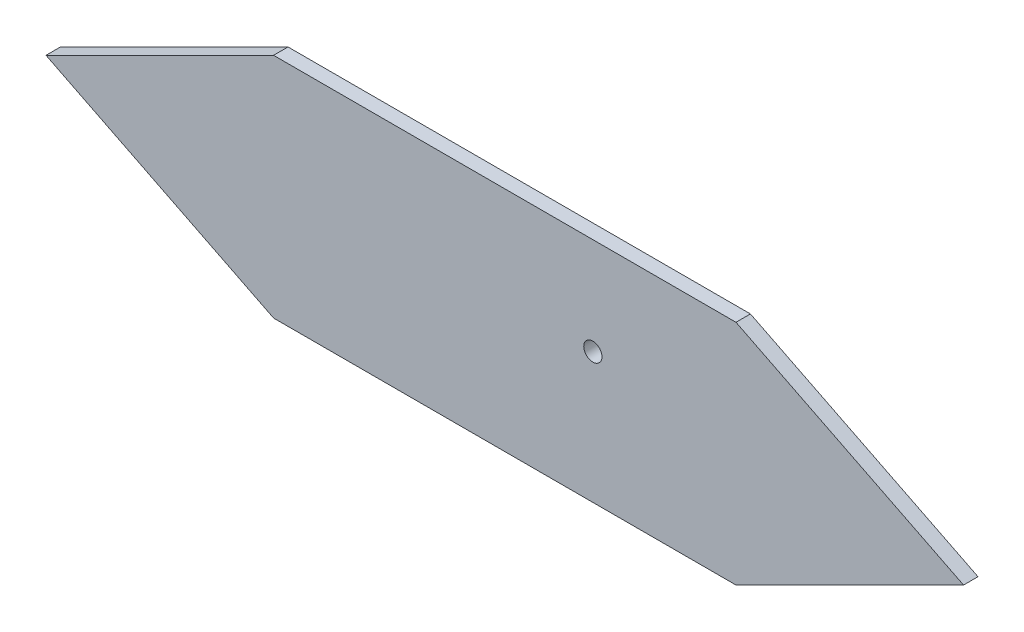
ISO-10303-21;
HEADER;
FILE_DESCRIPTION(('STEP AP214'),'2;1');
FILE_NAME('part.step','',(''),(''),'','','');
FILE_SCHEMA(('AUTOMOTIVE_DESIGN { 1 0 10303 214 1 1 1 1 }'));
ENDSEC;
DATA;
#1=APPLICATION_CONTEXT('core data for automotive mechanical design processes');
#2=APPLICATION_PROTOCOL_DEFINITION('international standard','automotive_design',2000,#1);
#3=PRODUCT_CONTEXT('',#1,'mechanical');
#4=PRODUCT('Part','Part','',(#3));
#5=PRODUCT_RELATED_PRODUCT_CATEGORY('part','',(#4));
#6=PRODUCT_DEFINITION_FORMATION('','',#4);
#7=PRODUCT_DEFINITION_CONTEXT('part definition',#1,'design');
#8=PRODUCT_DEFINITION('design','',#6,#7);
#9=PRODUCT_DEFINITION_SHAPE('','',#8);
#10=(LENGTH_UNIT() NAMED_UNIT(*) SI_UNIT(.MILLI.,.METRE.));
#11=(NAMED_UNIT(*) PLANE_ANGLE_UNIT() SI_UNIT($,.RADIAN.));
#12=(NAMED_UNIT(*) SI_UNIT($,.STERADIAN.) SOLID_ANGLE_UNIT());
#13=UNCERTAINTY_MEASURE_WITH_UNIT(LENGTH_MEASURE(1.E-05),#10,'distance_accuracy_value','');
#14=(GEOMETRIC_REPRESENTATION_CONTEXT(3) GLOBAL_UNCERTAINTY_ASSIGNED_CONTEXT((#13)) GLOBAL_UNIT_ASSIGNED_CONTEXT((#10,
#11,#12)) REPRESENTATION_CONTEXT('',''));
#15=CARTESIAN_POINT('',(0.,0.,0.));
#16=DIRECTION('',(0.,0.,1.));
#17=DIRECTION('',(1.,0.,0.));
#18=AXIS2_PLACEMENT_3D('',#15,#16,#17);
#19=CARTESIAN_POINT('',(0.,0.,0.));
#20=DIRECTION('',(0.,0.,1.));
#21=DIRECTION('',(1.,0.,0.));
#22=AXIS2_PLACEMENT_3D('',#19,#20,#21);
#23=PLANE('',#22);
#24=CARTESIAN_POINT('',(140.3,57.4,0.));
#25=DIRECTION('',(0.,0.,-1.));
#26=DIRECTION('',(-1.,0.,0.));
#27=AXIS2_PLACEMENT_3D('',#24,#25,#26);
#28=CIRCLE('',#27,3.99999999999999);
#29=CARTESIAN_POINT('',(136.3,57.4,0.));
#30=VERTEX_POINT('',#29);
#31=EDGE_CURVE('E723',#30,#30,#28,.T.);
#32=ORIENTED_EDGE('',*,*,#31,.F.);
#33=EDGE_LOOP('',(#32));
#34=FACE_BOUND('',#33,.T.);
#35=DIRECTION('',(-0.894427190999916,-0.447213595499958,0.));
#36=VECTOR('',#35,1.);
#37=CARTESIAN_POINT('',(-40.,80.,0.));
#38=LINE('',#37,#36);
#39=CARTESIAN_POINT('',(0.,100.,0.));
#40=VERTEX_POINT('',#39);
#41=CARTESIAN_POINT('',(-100.,50.,0.));
#42=VERTEX_POINT('',#41);
#43=EDGE_CURVE('E345',#40,#42,#38,.T.);
#44=ORIENTED_EDGE('',*,*,#43,.F.);
#45=DIRECTION('',(1.,0.,0.));
#46=VECTOR('',#45,1.);
#47=CARTESIAN_POINT('',(0.,100.,0.));
#48=LINE('',#47,#46);
#49=CARTESIAN_POINT('',(203.2,100.,0.));
#50=VERTEX_POINT('',#49);
#51=EDGE_CURVE('E350',#40,#50,#48,.T.);
#52=ORIENTED_EDGE('',*,*,#51,.T.);
#53=DIRECTION('',(0.894427190999916,-0.447213595499958,0.));
#54=VECTOR('',#53,1.);
#55=CARTESIAN_POINT('',(80.64,161.28,0.));
#56=LINE('',#55,#54);
#57=CARTESIAN_POINT('',(303.2,50.,0.));
#58=VERTEX_POINT('',#57);
#59=EDGE_CURVE('E374',#50,#58,#56,.T.);
#60=ORIENTED_EDGE('',*,*,#59,.T.);
#61=DIRECTION('',(-0.894427190999916,-0.447213595499958,0.));
#62=VECTOR('',#61,1.);
#63=CARTESIAN_POINT('',(40.64,-81.28,0.));
#64=LINE('',#63,#62);
#65=CARTESIAN_POINT('',(203.2,0.,0.));
#66=VERTEX_POINT('',#65);
#67=EDGE_CURVE('E371',#58,#66,#64,.T.);
#68=ORIENTED_EDGE('',*,*,#67,.T.);
#69=DIRECTION('',(1.,0.,0.));
#70=VECTOR('',#69,1.);
#71=CARTESIAN_POINT('',(0.,0.,0.));
#72=LINE('',#71,#70);
#73=CARTESIAN_POINT('',(0.,0.,0.));
#74=VERTEX_POINT('',#73);
#75=EDGE_CURVE('E368',#74,#66,#72,.T.);
#76=ORIENTED_EDGE('',*,*,#75,.F.);
#77=DIRECTION('',(0.894427190999916,-0.447213595499958,0.));
#78=VECTOR('',#77,1.);
#79=CARTESIAN_POINT('',(0.,0.,0.));
#80=LINE('',#79,#78);
#81=EDGE_CURVE('E366',#42,#74,#80,.T.);
#82=ORIENTED_EDGE('',*,*,#81,.F.);
#83=EDGE_LOOP('',(#44,#52,#60,#68,#76,#82));
#84=FACE_BOUND('',#83,.T.);
#85=DIRECTION('',(0.,-1.,0.));
#86=VECTOR('',#85,1.);
#87=CARTESIAN_POINT('',(0.,0.,0.));
#88=LINE('',#87,#86);
#89=CARTESIAN_POINT('',(0.,19.05,0.));
#90=VERTEX_POINT('',#89);
#91=CARTESIAN_POINT('',(0.,12.7,0.));
#92=VERTEX_POINT('',#91);
#93=EDGE_CURVE('E312',#90,#92,#88,.T.);
#94=ORIENTED_EDGE('',*,*,#93,.F.);
#95=DIRECTION('',(1.,0.,0.));
#96=VECTOR('',#95,1.);
#97=CARTESIAN_POINT('',(0.,19.05,0.));
#98=LINE('',#97,#96);
#99=CARTESIAN_POINT('',(25.4,19.05,0.));
#100=VERTEX_POINT('',#99);
#101=EDGE_CURVE('E243',#90,#100,#98,.T.);
#102=ORIENTED_EDGE('',*,*,#101,.T.);
#103=DIRECTION('',(0.,1.,0.));
#104=VECTOR('',#103,1.);
#105=CARTESIAN_POINT('',(25.4,0.,0.));
#106=LINE('',#105,#104);
#107=CARTESIAN_POINT('',(25.4,25.05,0.));
#108=VERTEX_POINT('',#107);
#109=EDGE_CURVE('E292',#100,#108,#106,.T.);
#110=ORIENTED_EDGE('',*,*,#109,.T.);
#111=DIRECTION('',(1.,0.,0.));
#112=VECTOR('',#111,1.);
#113=CARTESIAN_POINT('',(0.,25.05,0.));
#114=LINE('',#113,#112);
#115=CARTESIAN_POINT('',(-6.00000000000001,25.05,0.));
#116=VERTEX_POINT('',#115);
#117=EDGE_CURVE('E92',#116,#108,#114,.T.);
#118=ORIENTED_EDGE('',*,*,#117,.F.);
#119=DIRECTION('',(0.,-1.,0.));
#120=VECTOR('',#119,1.);
#121=CARTESIAN_POINT('',(-6.00000000000001,0.,0.));
#122=LINE('',#121,#120);
#123=CARTESIAN_POINT('',(-6.00000000000001,6.69999999999998,0.));
#124=VERTEX_POINT('',#123);
#125=EDGE_CURVE('E323',#116,#124,#122,.T.);
#126=ORIENTED_EDGE('',*,*,#125,.T.);
#127=DIRECTION('',(-1.,0.,0.));
#128=VECTOR('',#127,1.);
#129=CARTESIAN_POINT('',(0.,6.69999999999998,0.));
#130=LINE('',#129,#128);
#131=CARTESIAN_POINT('',(25.4,6.69999999999998,0.));
#132=VERTEX_POINT('',#131);
#133=EDGE_CURVE('E320',#132,#124,#130,.T.);
#134=ORIENTED_EDGE('',*,*,#133,.F.);
#135=DIRECTION('',(0.,1.,0.));
#136=VECTOR('',#135,1.);
#137=CARTESIAN_POINT('',(25.4,0.,0.));
#138=LINE('',#137,#136);
#139=CARTESIAN_POINT('',(25.4,12.7,0.));
#140=VERTEX_POINT('',#139);
#141=EDGE_CURVE('E317',#132,#140,#138,.T.);
#142=ORIENTED_EDGE('',*,*,#141,.T.);
#143=DIRECTION('',(1.,0.,0.));
#144=VECTOR('',#143,1.);
#145=CARTESIAN_POINT('',(0.,12.7,0.));
#146=LINE('',#145,#144);
#147=EDGE_CURVE('E314',#92,#140,#146,.T.);
#148=ORIENTED_EDGE('',*,*,#147,.F.);
#149=EDGE_LOOP('',(#94,#102,#110,#118,#126,#134,#142,#148));
#150=FACE_BOUND('',#149,.T.);
#151=DIRECTION('',(-1.,0.,0.));
#152=VECTOR('',#151,1.);
#153=CARTESIAN_POINT('',(0.,19.05,0.));
#154=LINE('',#153,#152);
#155=CARTESIAN_POINT('',(203.2,19.05,0.));
#156=VERTEX_POINT('',#155);
#157=CARTESIAN_POINT('',(177.8,19.05,0.));
#158=VERTEX_POINT('',#157);
#159=EDGE_CURVE('E235',#156,#158,#154,.T.);
#160=ORIENTED_EDGE('',*,*,#159,.F.);
#161=DIRECTION('',(0.,1.,0.));
#162=VECTOR('',#161,1.);
#163=CARTESIAN_POINT('',(203.2,0.,0.));
#164=LINE('',#163,#162);
#165=CARTESIAN_POINT('',(203.2,12.7,0.));
#166=VERTEX_POINT('',#165);
#167=EDGE_CURVE('E264',#166,#156,#164,.T.);
#168=ORIENTED_EDGE('',*,*,#167,.F.);
#169=DIRECTION('',(-1.,0.,0.));
#170=VECTOR('',#169,1.);
#171=CARTESIAN_POINT('',(203.2,12.7,0.));
#172=LINE('',#171,#170);
#173=CARTESIAN_POINT('',(177.8,12.7,0.));
#174=VERTEX_POINT('',#173);
#175=EDGE_CURVE('E241',#166,#174,#172,.T.);
#176=ORIENTED_EDGE('',*,*,#175,.T.);
#177=DIRECTION('',(0.,1.,0.));
#178=VECTOR('',#177,1.);
#179=CARTESIAN_POINT('',(177.8,6.69999999999998,0.));
#180=LINE('',#179,#178);
#181=CARTESIAN_POINT('',(177.8,6.69999999999998,0.));
#182=VERTEX_POINT('',#181);
#183=EDGE_CURVE('E84',#182,#174,#180,.T.);
#184=ORIENTED_EDGE('',*,*,#183,.F.);
#185=DIRECTION('',(-1.,0.,0.));
#186=VECTOR('',#185,1.);
#187=CARTESIAN_POINT('',(203.2,6.69999999999998,0.));
#188=LINE('',#187,#186);
#189=CARTESIAN_POINT('',(209.2,6.69999999999998,0.));
#190=VERTEX_POINT('',#189);
#191=EDGE_CURVE('E221',#190,#182,#188,.T.);
#192=ORIENTED_EDGE('',*,*,#191,.F.);
#193=DIRECTION('',(0.,-1.,0.));
#194=VECTOR('',#193,1.);
#195=CARTESIAN_POINT('',(209.2,0.,0.));
#196=LINE('',#195,#194);
#197=CARTESIAN_POINT('',(209.2,25.05,0.));
#198=VERTEX_POINT('',#197);
#199=EDGE_CURVE('E266',#198,#190,#196,.T.);
#200=ORIENTED_EDGE('',*,*,#199,.F.);
#201=DIRECTION('',(-1.,0.,0.));
#202=VECTOR('',#201,1.);
#203=CARTESIAN_POINT('',(0.,25.05,0.));
#204=LINE('',#203,#202);
#205=CARTESIAN_POINT('',(177.8,25.05,0.));
#206=VERTEX_POINT('',#205);
#207=EDGE_CURVE('E269',#198,#206,#204,.T.);
#208=ORIENTED_EDGE('',*,*,#207,.T.);
#209=DIRECTION('',(0.,1.,0.));
#210=VECTOR('',#209,1.);
#211=CARTESIAN_POINT('',(177.8,0.,0.));
#212=LINE('',#211,#210);
#213=EDGE_CURVE('E272',#158,#206,#212,.T.);
#214=ORIENTED_EDGE('',*,*,#213,.F.);
#215=EDGE_LOOP('',(#160,#168,#176,#184,#192,#200,#208,#214));
#216=FACE_BOUND('',#215,.T.);
#217=ADVANCED_FACE('F68',(#34,#84,#150,#216),#23,.F.);
#218=CARTESIAN_POINT('',(-40.,80.,6.35));
#219=DIRECTION('',(0.447213595499958,-0.894427190999916,0.));
#220=DIRECTION('',(0.894427190999916,0.447213595499958,0.));
#221=AXIS2_PLACEMENT_3D('',#218,#219,#220);
#222=PLANE('',#221);
#223=ORIENTED_EDGE('',*,*,#43,.T.);
#224=DIRECTION('',(0.,0.,-1.));
#225=VECTOR('',#224,1.);
#226=CARTESIAN_POINT('',(-100.,50.,6.35));
#227=LINE('',#226,#225);
#228=CARTESIAN_POINT('',(-100.,50.,6.35));
#229=VERTEX_POINT('',#228);
#230=EDGE_CURVE('E12',#229,#42,#227,.T.);
#231=ORIENTED_EDGE('',*,*,#230,.F.);
#232=DIRECTION('',(-0.894427190999916,-0.447213595499958,0.));
#233=VECTOR('',#232,1.);
#234=CARTESIAN_POINT('',(-40.,80.,6.35));
#235=LINE('',#234,#233);
#236=CARTESIAN_POINT('',(0.,100.,6.35));
#237=VERTEX_POINT('',#236);
#238=EDGE_CURVE('E346',#237,#229,#235,.T.);
#239=ORIENTED_EDGE('',*,*,#238,.F.);
#240=DIRECTION('',(0.,0.,-1.));
#241=VECTOR('',#240,1.);
#242=CARTESIAN_POINT('',(0.,100.,6.35));
#243=LINE('',#242,#241);
#244=EDGE_CURVE('E363',#237,#40,#243,.T.);
#245=ORIENTED_EDGE('',*,*,#244,.T.);
#246=EDGE_LOOP('',(#223,#231,#239,#245));
#247=FACE_BOUND('',#246,.T.);
#248=ADVANCED_FACE('F70',(#247),#222,.F.);
#249=CARTESIAN_POINT('',(0.,0.,6.35));
#250=DIRECTION('',(0.447213595499958,0.894427190999916,0.));
#251=DIRECTION('',(-0.894427190999916,0.447213595499958,0.));
#252=AXIS2_PLACEMENT_3D('',#249,#250,#251);
#253=PLANE('',#252);
#254=ORIENTED_EDGE('',*,*,#81,.T.);
#255=DIRECTION('',(0.,0.,-1.));
#256=VECTOR('',#255,1.);
#257=CARTESIAN_POINT('',(0.,0.,6.35));
#258=LINE('',#257,#256);
#259=CARTESIAN_POINT('',(0.,0.,6.35));
#260=VERTEX_POINT('',#259);
#261=EDGE_CURVE('E77',#260,#74,#258,.T.);
#262=ORIENTED_EDGE('',*,*,#261,.F.);
#263=DIRECTION('',(0.894427190999916,-0.447213595499958,0.));
#264=VECTOR('',#263,1.);
#265=CARTESIAN_POINT('',(0.,0.,6.35));
#266=LINE('',#265,#264);
#267=EDGE_CURVE('E349',#229,#260,#266,.T.);
#268=ORIENTED_EDGE('',*,*,#267,.F.);
#269=ORIENTED_EDGE('',*,*,#230,.T.);
#270=EDGE_LOOP('',(#254,#262,#268,#269));
#271=FACE_BOUND('',#270,.T.);
#272=ADVANCED_FACE('F414',(#271),#253,.F.);
#273=CARTESIAN_POINT('',(0.,0.,6.35));
#274=DIRECTION('',(0.,1.,0.));
#275=DIRECTION('',(0.,0.,1.));
#276=AXIS2_PLACEMENT_3D('',#273,#274,#275);
#277=PLANE('',#276);
#278=ORIENTED_EDGE('',*,*,#75,.T.);
#279=DIRECTION('',(0.,0.,-1.));
#280=VECTOR('',#279,1.);
#281=CARTESIAN_POINT('',(203.2,0.,6.35));
#282=LINE('',#281,#280);
#283=CARTESIAN_POINT('',(203.2,0.,6.35));
#284=VERTEX_POINT('',#283);
#285=EDGE_CURVE('E384',#284,#66,#282,.T.);
#286=ORIENTED_EDGE('',*,*,#285,.F.);
#287=DIRECTION('',(1.,0.,0.));
#288=VECTOR('',#287,1.);
#289=CARTESIAN_POINT('',(0.,0.,6.35));
#290=LINE('',#289,#288);
#291=EDGE_CURVE('E352',#260,#284,#290,.T.);
#292=ORIENTED_EDGE('',*,*,#291,.F.);
#293=ORIENTED_EDGE('',*,*,#261,.T.);
#294=EDGE_LOOP('',(#278,#286,#292,#293));
#295=FACE_BOUND('',#294,.T.);
#296=ADVANCED_FACE('F391',(#295),#277,.F.);
#297=CARTESIAN_POINT('',(40.64,-81.28,6.35));
#298=DIRECTION('',(0.447213595499958,-0.894427190999916,0.));
#299=DIRECTION('',(0.894427190999916,0.447213595499958,0.));
#300=AXIS2_PLACEMENT_3D('',#297,#298,#299);
#301=PLANE('',#300);
#302=ORIENTED_EDGE('',*,*,#67,.F.);
#303=DIRECTION('',(0.,0.,-1.));
#304=VECTOR('',#303,1.);
#305=CARTESIAN_POINT('',(303.2,50.,6.35));
#306=LINE('',#305,#304);
#307=CARTESIAN_POINT('',(303.2,50.,6.35));
#308=VERTEX_POINT('',#307);
#309=EDGE_CURVE('E382',#308,#58,#306,.T.);
#310=ORIENTED_EDGE('',*,*,#309,.F.);
#311=DIRECTION('',(-0.894427190999916,-0.447213595499958,0.));
#312=VECTOR('',#311,1.);
#313=CARTESIAN_POINT('',(40.64,-81.28,6.35));
#314=LINE('',#313,#312);
#315=EDGE_CURVE('E354',#308,#284,#314,.T.);
#316=ORIENTED_EDGE('',*,*,#315,.T.);
#317=ORIENTED_EDGE('',*,*,#285,.T.);
#318=EDGE_LOOP('',(#302,#310,#316,#317));
#319=FACE_BOUND('',#318,.T.);
#320=ADVANCED_FACE('F400',(#319),#301,.T.);
#321=CARTESIAN_POINT('',(80.64,161.28,6.35));
#322=DIRECTION('',(0.447213595499958,0.894427190999916,0.));
#323=DIRECTION('',(-0.894427190999916,0.447213595499958,0.));
#324=AXIS2_PLACEMENT_3D('',#321,#322,#323);
#325=PLANE('',#324);
#326=ORIENTED_EDGE('',*,*,#59,.F.);
#327=DIRECTION('',(0.,0.,-1.));
#328=VECTOR('',#327,1.);
#329=CARTESIAN_POINT('',(203.2,100.,6.35));
#330=LINE('',#329,#328);
#331=CARTESIAN_POINT('',(203.2,100.,6.35));
#332=VERTEX_POINT('',#331);
#333=EDGE_CURVE('E380',#332,#50,#330,.T.);
#334=ORIENTED_EDGE('',*,*,#333,.F.);
#335=DIRECTION('',(0.894427190999916,-0.447213595499958,0.));
#336=VECTOR('',#335,1.);
#337=CARTESIAN_POINT('',(80.64,161.28,6.35));
#338=LINE('',#337,#336);
#339=EDGE_CURVE('E357',#332,#308,#338,.T.);
#340=ORIENTED_EDGE('',*,*,#339,.T.);
#341=ORIENTED_EDGE('',*,*,#309,.T.);
#342=EDGE_LOOP('',(#326,#334,#340,#341));
#343=FACE_BOUND('',#342,.T.);
#344=ADVANCED_FACE('F407',(#343),#325,.T.);
#345=CARTESIAN_POINT('',(0.,100.,6.35));
#346=DIRECTION('',(0.,1.,0.));
#347=DIRECTION('',(0.,0.,1.));
#348=AXIS2_PLACEMENT_3D('',#345,#346,#347);
#349=PLANE('',#348);
#350=ORIENTED_EDGE('',*,*,#51,.F.);
#351=ORIENTED_EDGE('',*,*,#244,.F.);
#352=DIRECTION('',(1.,0.,0.));
#353=VECTOR('',#352,1.);
#354=CARTESIAN_POINT('',(0.,100.,6.35));
#355=LINE('',#354,#353);
#356=EDGE_CURVE('E360',#237,#332,#355,.T.);
#357=ORIENTED_EDGE('',*,*,#356,.T.);
#358=ORIENTED_EDGE('',*,*,#333,.T.);
#359=EDGE_LOOP('',(#350,#351,#357,#358));
#360=FACE_BOUND('',#359,.T.);
#361=ADVANCED_FACE('F410',(#360),#349,.T.);
#362=CARTESIAN_POINT('',(0.,0.,6.35));
#363=DIRECTION('',(0.,0.,1.));
#364=DIRECTION('',(1.,0.,0.));
#365=AXIS2_PLACEMENT_3D('',#362,#363,#364);
#366=PLANE('',#365);
#367=CARTESIAN_POINT('',(140.3,57.4,6.35));
#368=DIRECTION('',(0.,0.,1.));
#369=DIRECTION('',(1.,0.,0.));
#370=AXIS2_PLACEMENT_3D('',#367,#368,#369);
#371=CIRCLE('',#370,3.99999999999999);
#372=CARTESIAN_POINT('',(144.3,57.4,6.35));
#373=VERTEX_POINT('',#372);
#374=EDGE_CURVE('E72',#373,#373,#371,.T.);
#375=ORIENTED_EDGE('',*,*,#374,.F.);
#376=EDGE_LOOP('',(#375));
#377=FACE_BOUND('',#376,.T.);
#378=ORIENTED_EDGE('',*,*,#238,.T.);
#379=ORIENTED_EDGE('',*,*,#267,.T.);
#380=ORIENTED_EDGE('',*,*,#291,.T.);
#381=ORIENTED_EDGE('',*,*,#315,.F.);
#382=ORIENTED_EDGE('',*,*,#339,.F.);
#383=ORIENTED_EDGE('',*,*,#356,.F.);
#384=EDGE_LOOP('',(#378,#379,#380,#381,#382,#383));
#385=FACE_BOUND('',#384,.T.);
#386=ADVANCED_FACE('F404',(#377,#385),#366,.T.);
#387=CARTESIAN_POINT('',(0.,19.05,-25.));
#388=DIRECTION('',(0.,-1.,0.));
#389=DIRECTION('',(0.,0.,-1.));
#390=AXIS2_PLACEMENT_3D('',#387,#388,#389);
#391=PLANE('',#390);
#392=ORIENTED_EDGE('',*,*,#101,.F.);
#393=DIRECTION('',(0.,0.,1.));
#394=VECTOR('',#393,1.);
#395=CARTESIAN_POINT('',(0.,19.05,-25.));
#396=LINE('',#395,#394);
#397=CARTESIAN_POINT('',(0.,19.05,-25.));
#398=VERTEX_POINT('',#397);
#399=EDGE_CURVE('E343',#398,#90,#396,.T.);
#400=ORIENTED_EDGE('',*,*,#399,.F.);
#401=DIRECTION('',(1.,0.,0.));
#402=VECTOR('',#401,1.);
#403=CARTESIAN_POINT('',(0.,19.05,-25.));
#404=LINE('',#403,#402);
#405=CARTESIAN_POINT('',(25.4,19.05,-25.));
#406=VERTEX_POINT('',#405);
#407=EDGE_CURVE('E288',#398,#406,#404,.T.);
#408=ORIENTED_EDGE('',*,*,#407,.T.);
#409=DIRECTION('',(0.,0.,1.));
#410=VECTOR('',#409,1.);
#411=CARTESIAN_POINT('',(25.4,19.05,-25.));
#412=LINE('',#411,#410);
#413=EDGE_CURVE('E309',#406,#100,#412,.T.);
#414=ORIENTED_EDGE('',*,*,#413,.T.);
#415=EDGE_LOOP('',(#392,#400,#408,#414));
#416=FACE_BOUND('',#415,.T.);
#417=ADVANCED_FACE('F454',(#416),#391,.T.);
#418=CARTESIAN_POINT('',(0.,0.,-25.));
#419=DIRECTION('',(-1.,0.,0.));
#420=DIRECTION('',(0.,0.,1.));
#421=AXIS2_PLACEMENT_3D('',#418,#419,#420);
#422=PLANE('',#421);
#423=ORIENTED_EDGE('',*,*,#93,.T.);
#424=DIRECTION('',(0.,0.,1.));
#425=VECTOR('',#424,1.);
#426=CARTESIAN_POINT('',(0.,12.7,-25.));
#427=LINE('',#426,#425);
#428=CARTESIAN_POINT('',(0.,12.7,-25.));
#429=VERTEX_POINT('',#428);
#430=EDGE_CURVE('E340',#429,#92,#427,.T.);
#431=ORIENTED_EDGE('',*,*,#430,.F.);
#432=DIRECTION('',(0.,-1.,0.));
#433=VECTOR('',#432,1.);
#434=CARTESIAN_POINT('',(0.,0.,-25.));
#435=LINE('',#434,#433);
#436=EDGE_CURVE('E291',#398,#429,#435,.T.);
#437=ORIENTED_EDGE('',*,*,#436,.F.);
#438=ORIENTED_EDGE('',*,*,#399,.T.);
#439=EDGE_LOOP('',(#423,#431,#437,#438));
#440=FACE_BOUND('',#439,.T.);
#441=ADVANCED_FACE('F461',(#440),#422,.F.);
#442=CARTESIAN_POINT('',(0.,12.7,-25.));
#443=DIRECTION('',(0.,-1.,0.));
#444=DIRECTION('',(0.,0.,-1.));
#445=AXIS2_PLACEMENT_3D('',#442,#443,#444);
#446=PLANE('',#445);
#447=ORIENTED_EDGE('',*,*,#147,.T.);
#448=DIRECTION('',(0.,0.,1.));
#449=VECTOR('',#448,1.);
#450=CARTESIAN_POINT('',(25.4,12.7,-25.));
#451=LINE('',#450,#449);
#452=CARTESIAN_POINT('',(25.4,12.7,-25.));
#453=VERTEX_POINT('',#452);
#454=EDGE_CURVE('E338',#453,#140,#451,.T.);
#455=ORIENTED_EDGE('',*,*,#454,.F.);
#456=DIRECTION('',(1.,0.,0.));
#457=VECTOR('',#456,1.);
#458=CARTESIAN_POINT('',(0.,12.7,-25.));
#459=LINE('',#458,#457);
#460=EDGE_CURVE('E294',#429,#453,#459,.T.);
#461=ORIENTED_EDGE('',*,*,#460,.F.);
#462=ORIENTED_EDGE('',*,*,#430,.T.);
#463=EDGE_LOOP('',(#447,#455,#461,#462));
#464=FACE_BOUND('',#463,.T.);
#465=ADVANCED_FACE('F468',(#464),#446,.F.);
#466=CARTESIAN_POINT('',(25.4,0.,-25.));
#467=DIRECTION('',(1.,0.,0.));
#468=DIRECTION('',(0.,0.,-1.));
#469=AXIS2_PLACEMENT_3D('',#466,#467,#468);
#470=PLANE('',#469);
#471=ORIENTED_EDGE('',*,*,#141,.F.);
#472=DIRECTION('',(0.,0.,1.));
#473=VECTOR('',#472,1.);
#474=CARTESIAN_POINT('',(25.4,6.69999999999998,-25.));
#475=LINE('',#474,#473);
#476=CARTESIAN_POINT('',(25.4,6.69999999999998,-25.));
#477=VERTEX_POINT('',#476);
#478=EDGE_CURVE('E336',#477,#132,#475,.T.);
#479=ORIENTED_EDGE('',*,*,#478,.F.);
#480=DIRECTION('',(0.,1.,0.));
#481=VECTOR('',#480,1.);
#482=CARTESIAN_POINT('',(25.4,0.,-25.));
#483=LINE('',#482,#481);
#484=EDGE_CURVE('E296',#477,#453,#483,.T.);
#485=ORIENTED_EDGE('',*,*,#484,.T.);
#486=ORIENTED_EDGE('',*,*,#454,.T.);
#487=EDGE_LOOP('',(#471,#479,#485,#486));
#488=FACE_BOUND('',#487,.T.);
#489=ADVANCED_FACE('F476',(#488),#470,.T.);
#490=CARTESIAN_POINT('',(0.,6.69999999999998,-25.));
#491=DIRECTION('',(0.,1.,0.));
#492=DIRECTION('',(0.,0.,1.));
#493=AXIS2_PLACEMENT_3D('',#490,#491,#492);
#494=PLANE('',#493);
#495=ORIENTED_EDGE('',*,*,#133,.T.);
#496=DIRECTION('',(0.,0.,1.));
#497=VECTOR('',#496,1.);
#498=CARTESIAN_POINT('',(-6.00000000000001,6.69999999999998,-25.));
#499=LINE('',#498,#497);
#500=CARTESIAN_POINT('',(-6.00000000000001,6.69999999999998,-25.));
#501=VERTEX_POINT('',#500);
#502=EDGE_CURVE('E334',#501,#124,#499,.T.);
#503=ORIENTED_EDGE('',*,*,#502,.F.);
#504=DIRECTION('',(-1.,0.,0.));
#505=VECTOR('',#504,1.);
#506=CARTESIAN_POINT('',(0.,6.69999999999998,-25.));
#507=LINE('',#506,#505);
#508=EDGE_CURVE('E299',#477,#501,#507,.T.);
#509=ORIENTED_EDGE('',*,*,#508,.F.);
#510=ORIENTED_EDGE('',*,*,#478,.T.);
#511=EDGE_LOOP('',(#495,#503,#509,#510));
#512=FACE_BOUND('',#511,.T.);
#513=ADVANCED_FACE('F484',(#512),#494,.F.);
#514=CARTESIAN_POINT('',(-6.00000000000001,0.,-25.));
#515=DIRECTION('',(-1.,0.,0.));
#516=DIRECTION('',(0.,0.,1.));
#517=AXIS2_PLACEMENT_3D('',#514,#515,#516);
#518=PLANE('',#517);
#519=ORIENTED_EDGE('',*,*,#125,.F.);
#520=DIRECTION('',(0.,0.,1.));
#521=VECTOR('',#520,1.);
#522=CARTESIAN_POINT('',(-6.00000000000001,25.05,-25.));
#523=LINE('',#522,#521);
#524=CARTESIAN_POINT('',(-6.00000000000001,25.05,-25.));
#525=VERTEX_POINT('',#524);
#526=EDGE_CURVE('E332',#525,#116,#523,.T.);
#527=ORIENTED_EDGE('',*,*,#526,.F.);
#528=DIRECTION('',(0.,-1.,0.));
#529=VECTOR('',#528,1.);
#530=CARTESIAN_POINT('',(-6.00000000000001,0.,-25.));
#531=LINE('',#530,#529);
#532=EDGE_CURVE('E301',#525,#501,#531,.T.);
#533=ORIENTED_EDGE('',*,*,#532,.T.);
#534=ORIENTED_EDGE('',*,*,#502,.T.);
#535=EDGE_LOOP('',(#519,#527,#533,#534));
#536=FACE_BOUND('',#535,.T.);
#537=ADVANCED_FACE('F492',(#536),#518,.T.);
#538=CARTESIAN_POINT('',(0.,25.05,-25.));
#539=DIRECTION('',(0.,-1.,0.));
#540=DIRECTION('',(0.,0.,-1.));
#541=AXIS2_PLACEMENT_3D('',#538,#539,#540);
#542=PLANE('',#541);
#543=ORIENTED_EDGE('',*,*,#117,.T.);
#544=DIRECTION('',(0.,0.,1.));
#545=VECTOR('',#544,1.);
#546=CARTESIAN_POINT('',(25.4,25.05,-25.));
#547=LINE('',#546,#545);
#548=CARTESIAN_POINT('',(25.4,25.05,-25.));
#549=VERTEX_POINT('',#548);
#550=EDGE_CURVE('E330',#549,#108,#547,.T.);
#551=ORIENTED_EDGE('',*,*,#550,.F.);
#552=DIRECTION('',(1.,0.,0.));
#553=VECTOR('',#552,1.);
#554=CARTESIAN_POINT('',(0.,25.05,-25.));
#555=LINE('',#554,#553);
#556=EDGE_CURVE('E304',#525,#549,#555,.T.);
#557=ORIENTED_EDGE('',*,*,#556,.F.);
#558=ORIENTED_EDGE('',*,*,#526,.T.);
#559=EDGE_LOOP('',(#543,#551,#557,#558));
#560=FACE_BOUND('',#559,.T.);
#561=ADVANCED_FACE('F500',(#560),#542,.F.);
#562=CARTESIAN_POINT('',(25.4,0.,-25.));
#563=DIRECTION('',(1.,0.,0.));
#564=DIRECTION('',(0.,0.,-1.));
#565=AXIS2_PLACEMENT_3D('',#562,#563,#564);
#566=PLANE('',#565);
#567=ORIENTED_EDGE('',*,*,#109,.F.);
#568=ORIENTED_EDGE('',*,*,#413,.F.);
#569=DIRECTION('',(0.,1.,0.));
#570=VECTOR('',#569,1.);
#571=CARTESIAN_POINT('',(25.4,0.,-25.));
#572=LINE('',#571,#570);
#573=EDGE_CURVE('E306',#406,#549,#572,.T.);
#574=ORIENTED_EDGE('',*,*,#573,.T.);
#575=ORIENTED_EDGE('',*,*,#550,.T.);
#576=EDGE_LOOP('',(#567,#568,#574,#575));
#577=FACE_BOUND('',#576,.T.);
#578=ADVANCED_FACE('F508',(#577),#566,.T.);
#579=CARTESIAN_POINT('',(0.,0.,-25.));
#580=DIRECTION('',(0.,0.,-1.));
#581=DIRECTION('',(-1.,0.,0.));
#582=AXIS2_PLACEMENT_3D('',#579,#580,#581);
#583=PLANE('',#582);
#584=ORIENTED_EDGE('',*,*,#407,.F.);
#585=ORIENTED_EDGE('',*,*,#436,.T.);
#586=ORIENTED_EDGE('',*,*,#460,.T.);
#587=ORIENTED_EDGE('',*,*,#484,.F.);
#588=ORIENTED_EDGE('',*,*,#508,.T.);
#589=ORIENTED_EDGE('',*,*,#532,.F.);
#590=ORIENTED_EDGE('',*,*,#556,.T.);
#591=ORIENTED_EDGE('',*,*,#573,.F.);
#592=EDGE_LOOP('',(#584,#585,#586,#587,#588,#589,#590,#591));
#593=FACE_BOUND('',#592,.T.);
#594=ADVANCED_FACE('F515',(#593),#583,.T.);
#595=CARTESIAN_POINT('',(0.,19.05,-25.));
#596=DIRECTION('',(0.,1.,0.));
#597=DIRECTION('',(0.,0.,1.));
#598=AXIS2_PLACEMENT_3D('',#595,#596,#597);
#599=PLANE('',#598);
#600=ORIENTED_EDGE('',*,*,#159,.T.);
#601=DIRECTION('',(0.,0.,1.));
#602=VECTOR('',#601,1.);
#603=CARTESIAN_POINT('',(177.8,19.05,-25.));
#604=LINE('',#603,#602);
#605=CARTESIAN_POINT('',(177.8,19.05,-25.));
#606=VERTEX_POINT('',#605);
#607=EDGE_CURVE('E252',#606,#158,#604,.T.);
#608=ORIENTED_EDGE('',*,*,#607,.F.);
#609=DIRECTION('',(-1.,0.,0.));
#610=VECTOR('',#609,1.);
#611=CARTESIAN_POINT('',(0.,19.05,-25.));
#612=LINE('',#611,#610);
#613=CARTESIAN_POINT('',(203.2,19.05,-25.));
#614=VERTEX_POINT('',#613);
#615=EDGE_CURVE('E267',#614,#606,#612,.T.);
#616=ORIENTED_EDGE('',*,*,#615,.F.);
#617=DIRECTION('',(0.,0.,1.));
#618=VECTOR('',#617,1.);
#619=CARTESIAN_POINT('',(203.2,19.05,-25.));
#620=LINE('',#619,#618);
#621=EDGE_CURVE('E260',#614,#156,#620,.T.);
#622=ORIENTED_EDGE('',*,*,#621,.T.);
#623=EDGE_LOOP('',(#600,#608,#616,#622));
#624=FACE_BOUND('',#623,.T.);
#625=ADVANCED_FACE('F523',(#624),#599,.F.);
#626=CARTESIAN_POINT('',(177.8,0.,-25.));
#627=DIRECTION('',(1.,0.,0.));
#628=DIRECTION('',(0.,0.,-1.));
#629=AXIS2_PLACEMENT_3D('',#626,#627,#628);
#630=PLANE('',#629);
#631=ORIENTED_EDGE('',*,*,#213,.T.);
#632=DIRECTION('',(0.,0.,1.));
#633=VECTOR('',#632,1.);
#634=CARTESIAN_POINT('',(177.8,25.05,-25.));
#635=LINE('',#634,#633);
#636=CARTESIAN_POINT('',(177.8,25.05,-25.));
#637=VERTEX_POINT('',#636);
#638=EDGE_CURVE('E254',#637,#206,#635,.T.);
#639=ORIENTED_EDGE('',*,*,#638,.F.);
#640=DIRECTION('',(0.,1.,0.));
#641=VECTOR('',#640,1.);
#642=CARTESIAN_POINT('',(177.8,0.,-25.));
#643=LINE('',#642,#641);
#644=EDGE_CURVE('E284',#606,#637,#643,.T.);
#645=ORIENTED_EDGE('',*,*,#644,.F.);
#646=ORIENTED_EDGE('',*,*,#607,.T.);
#647=EDGE_LOOP('',(#631,#639,#645,#646));
#648=FACE_BOUND('',#647,.T.);
#649=ADVANCED_FACE('F532',(#648),#630,.F.);
#650=CARTESIAN_POINT('',(0.,25.05,-25.));
#651=DIRECTION('',(0.,1.,0.));
#652=DIRECTION('',(0.,0.,1.));
#653=AXIS2_PLACEMENT_3D('',#650,#651,#652);
#654=PLANE('',#653);
#655=ORIENTED_EDGE('',*,*,#207,.F.);
#656=DIRECTION('',(0.,0.,1.));
#657=VECTOR('',#656,1.);
#658=CARTESIAN_POINT('',(209.2,25.05,-25.));
#659=LINE('',#658,#657);
#660=CARTESIAN_POINT('',(209.2,25.05,-25.));
#661=VERTEX_POINT('',#660);
#662=EDGE_CURVE('E257',#661,#198,#659,.T.);
#663=ORIENTED_EDGE('',*,*,#662,.F.);
#664=DIRECTION('',(-1.,0.,0.));
#665=VECTOR('',#664,1.);
#666=CARTESIAN_POINT('',(0.,25.05,-25.));
#667=LINE('',#666,#665);
#668=EDGE_CURVE('E281',#661,#637,#667,.T.);
#669=ORIENTED_EDGE('',*,*,#668,.T.);
#670=ORIENTED_EDGE('',*,*,#638,.T.);
#671=EDGE_LOOP('',(#655,#663,#669,#670));
#672=FACE_BOUND('',#671,.T.);
#673=ADVANCED_FACE('F540',(#672),#654,.T.);
#674=CARTESIAN_POINT('',(209.2,0.,-25.));
#675=DIRECTION('',(-1.,0.,0.));
#676=DIRECTION('',(0.,0.,1.));
#677=AXIS2_PLACEMENT_3D('',#674,#675,#676);
#678=PLANE('',#677);
#679=ORIENTED_EDGE('',*,*,#199,.T.);
#680=DIRECTION('',(0.,0.,1.));
#681=VECTOR('',#680,1.);
#682=CARTESIAN_POINT('',(209.2,6.69999999999998,-25.));
#683=LINE('',#682,#681);
#684=CARTESIAN_POINT('',(209.2,6.69999999999998,-25.));
#685=VERTEX_POINT('',#684);
#686=EDGE_CURVE('E226',#685,#190,#683,.T.);
#687=ORIENTED_EDGE('',*,*,#686,.F.);
#688=DIRECTION('',(0.,-1.,0.));
#689=VECTOR('',#688,1.);
#690=CARTESIAN_POINT('',(209.2,0.,-25.));
#691=LINE('',#690,#689);
#692=EDGE_CURVE('E278',#661,#685,#691,.T.);
#693=ORIENTED_EDGE('',*,*,#692,.F.);
#694=ORIENTED_EDGE('',*,*,#662,.T.);
#695=EDGE_LOOP('',(#679,#687,#693,#694));
#696=FACE_BOUND('',#695,.T.);
#697=ADVANCED_FACE('F548',(#696),#678,.F.);
#698=CARTESIAN_POINT('',(0.,6.69999999999998,-25.));
#699=DIRECTION('',(0.,-1.,0.));
#700=DIRECTION('',(0.,0.,-1.));
#701=AXIS2_PLACEMENT_3D('',#698,#699,#700);
#702=PLANE('',#701);
#703=ORIENTED_EDGE('',*,*,#686,.T.);
#704=ORIENTED_EDGE('',*,*,#191,.T.);
#705=DIRECTION('',(0.,0.,1.));
#706=VECTOR('',#705,1.);
#707=CARTESIAN_POINT('',(177.8,6.69999999999998,-25.));
#708=LINE('',#707,#706);
#709=CARTESIAN_POINT('',(177.8,6.69999999999998,-25.));
#710=VERTEX_POINT('',#709);
#711=EDGE_CURVE('E223',#710,#182,#708,.T.);
#712=ORIENTED_EDGE('',*,*,#711,.F.);
#713=DIRECTION('',(-1.,0.,0.));
#714=VECTOR('',#713,1.);
#715=CARTESIAN_POINT('',(203.2,6.69999999999998,-25.));
#716=LINE('',#715,#714);
#717=EDGE_CURVE('E247',#685,#710,#716,.T.);
#718=ORIENTED_EDGE('',*,*,#717,.F.);
#719=EDGE_LOOP('',(#703,#704,#712,#718));
#720=FACE_BOUND('',#719,.T.);
#721=ADVANCED_FACE('F222',(#720),#702,.T.);
#722=CARTESIAN_POINT('',(203.2,0.,-25.));
#723=DIRECTION('',(1.,0.,0.));
#724=DIRECTION('',(0.,0.,-1.));
#725=AXIS2_PLACEMENT_3D('',#722,#723,#724);
#726=PLANE('',#725);
#727=DIRECTION('',(0.,1.,0.));
#728=VECTOR('',#727,1.);
#729=CARTESIAN_POINT('',(203.2,0.,-25.));
#730=LINE('',#729,#728);
#731=CARTESIAN_POINT('',(203.2,12.7,-25.));
#732=VERTEX_POINT('',#731);
#733=EDGE_CURVE('E263',#732,#614,#730,.T.);
#734=ORIENTED_EDGE('',*,*,#733,.F.);
#735=DIRECTION('',(0.,0.,1.));
#736=VECTOR('',#735,1.);
#737=CARTESIAN_POINT('',(203.2,12.7,-25.));
#738=LINE('',#737,#736);
#739=EDGE_CURVE('E255',#732,#166,#738,.T.);
#740=ORIENTED_EDGE('',*,*,#739,.T.);
#741=ORIENTED_EDGE('',*,*,#167,.T.);
#742=ORIENTED_EDGE('',*,*,#621,.F.);
#743=EDGE_LOOP('',(#734,#740,#741,#742));
#744=FACE_BOUND('',#743,.T.);
#745=ADVANCED_FACE('F563',(#744),#726,.F.);
#746=CARTESIAN_POINT('',(0.,0.,-25.));
#747=DIRECTION('',(0.,0.,-1.));
#748=DIRECTION('',(-1.,0.,0.));
#749=AXIS2_PLACEMENT_3D('',#746,#747,#748);
#750=PLANE('',#749);
#751=ORIENTED_EDGE('',*,*,#615,.T.);
#752=ORIENTED_EDGE('',*,*,#644,.T.);
#753=ORIENTED_EDGE('',*,*,#668,.F.);
#754=ORIENTED_EDGE('',*,*,#692,.T.);
#755=ORIENTED_EDGE('',*,*,#717,.T.);
#756=DIRECTION('',(0.,1.,0.));
#757=VECTOR('',#756,1.);
#758=CARTESIAN_POINT('',(177.8,6.69999999999998,-25.));
#759=LINE('',#758,#757);
#760=CARTESIAN_POINT('',(177.8,12.7,-25.));
#761=VERTEX_POINT('',#760);
#762=EDGE_CURVE('E233',#710,#761,#759,.T.);
#763=ORIENTED_EDGE('',*,*,#762,.T.);
#764=DIRECTION('',(-1.,0.,0.));
#765=VECTOR('',#764,1.);
#766=CARTESIAN_POINT('',(203.2,12.7,-25.));
#767=LINE('',#766,#765);
#768=EDGE_CURVE('E230',#732,#761,#767,.T.);
#769=ORIENTED_EDGE('',*,*,#768,.F.);
#770=ORIENTED_EDGE('',*,*,#733,.T.);
#771=EDGE_LOOP('',(#751,#752,#753,#754,#755,#763,#769,#770));
#772=FACE_BOUND('',#771,.T.);
#773=ADVANCED_FACE('F570',(#772),#750,.T.);
#774=CARTESIAN_POINT('',(177.8,6.69999999999998,-25.));
#775=DIRECTION('',(1.,0.,0.));
#776=DIRECTION('',(0.,0.,-1.));
#777=AXIS2_PLACEMENT_3D('',#774,#775,#776);
#778=PLANE('',#777);
#779=ORIENTED_EDGE('',*,*,#183,.T.);
#780=DIRECTION('',(0.,0.,1.));
#781=VECTOR('',#780,1.);
#782=CARTESIAN_POINT('',(177.8,12.7,-25.));
#783=LINE('',#782,#781);
#784=EDGE_CURVE('E234',#761,#174,#783,.T.);
#785=ORIENTED_EDGE('',*,*,#784,.F.);
#786=ORIENTED_EDGE('',*,*,#762,.F.);
#787=ORIENTED_EDGE('',*,*,#711,.T.);
#788=EDGE_LOOP('',(#779,#785,#786,#787));
#789=FACE_BOUND('',#788,.T.);
#790=ADVANCED_FACE('F232',(#789),#778,.F.);
#791=CARTESIAN_POINT('',(203.2,12.7,-25.));
#792=DIRECTION('',(0.,1.,0.));
#793=DIRECTION('',(0.,0.,1.));
#794=AXIS2_PLACEMENT_3D('',#791,#792,#793);
#795=PLANE('',#794);
#796=ORIENTED_EDGE('',*,*,#175,.F.);
#797=ORIENTED_EDGE('',*,*,#739,.F.);
#798=ORIENTED_EDGE('',*,*,#768,.T.);
#799=ORIENTED_EDGE('',*,*,#784,.T.);
#800=EDGE_LOOP('',(#796,#797,#798,#799));
#801=FACE_BOUND('',#800,.T.);
#802=ADVANCED_FACE('F526',(#801),#795,.T.);
#803=CARTESIAN_POINT('',(140.3,57.4,25.));
#804=DIRECTION('',(0.,0.,-1.));
#805=DIRECTION('',(-1.,0.,0.));
#806=AXIS2_PLACEMENT_3D('',#803,#804,#805);
#807=CYLINDRICAL_SURFACE('',#806,3.99999999999999);
#808=ORIENTED_EDGE('',*,*,#374,.T.);
#809=EDGE_LOOP('',(#808));
#810=FACE_BOUND('',#809,.T.);
#811=ORIENTED_EDGE('',*,*,#31,.T.);
#812=EDGE_LOOP('',(#811));
#813=FACE_BOUND('',#812,.T.);
#814=ADVANCED_FACE('F580',(#810,#813),#807,.F.);
#815=CLOSED_SHELL('',(#217,#248,#272,#296,#320,#344,#361,#386,#417,#441,#465,#489,#513,#537,
#561,#578,#594,#625,#649,#673,#697,#721,#745,#773,#790,#802,#814));
#816=MANIFOLD_SOLID_BREP('B2',#815);
#817=ADVANCED_BREP_SHAPE_REPRESENTATION('',(#18,#816),#14);
#818=SHAPE_DEFINITION_REPRESENTATION(#9,#817);
ENDSEC;
END-ISO-10303-21;
